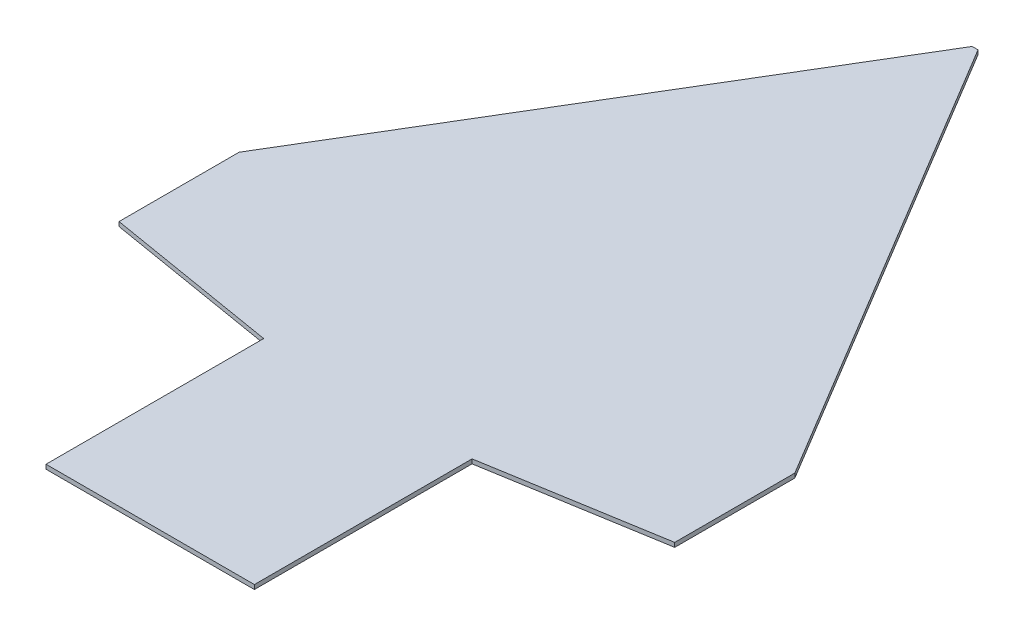
ISO-10303-21;
HEADER;
FILE_DESCRIPTION(('STEP AP214'),'2;1');
FILE_NAME('part.step','',(''),(''),'','','');
FILE_SCHEMA(('AUTOMOTIVE_DESIGN { 1 0 10303 214 1 1 1 1 }'));
ENDSEC;
DATA;
#1=APPLICATION_CONTEXT('core data for automotive mechanical design processes');
#2=APPLICATION_PROTOCOL_DEFINITION('international standard','automotive_design',2000,#1);
#3=PRODUCT_CONTEXT('',#1,'mechanical');
#4=PRODUCT('Part','Part','',(#3));
#5=PRODUCT_RELATED_PRODUCT_CATEGORY('part','',(#4));
#6=PRODUCT_DEFINITION_FORMATION('','',#4);
#7=PRODUCT_DEFINITION_CONTEXT('part definition',#1,'design');
#8=PRODUCT_DEFINITION('design','',#6,#7);
#9=PRODUCT_DEFINITION_SHAPE('','',#8);
#10=(LENGTH_UNIT() NAMED_UNIT(*) SI_UNIT(.MILLI.,.METRE.));
#11=(NAMED_UNIT(*) PLANE_ANGLE_UNIT() SI_UNIT($,.RADIAN.));
#12=(NAMED_UNIT(*) SI_UNIT($,.STERADIAN.) SOLID_ANGLE_UNIT());
#13=UNCERTAINTY_MEASURE_WITH_UNIT(LENGTH_MEASURE(1.E-05),#10,'distance_accuracy_value','');
#14=(GEOMETRIC_REPRESENTATION_CONTEXT(3) GLOBAL_UNCERTAINTY_ASSIGNED_CONTEXT((#13)) GLOBAL_UNIT_ASSIGNED_CONTEXT((#10,
#11,#12)) REPRESENTATION_CONTEXT('',''));
#15=CARTESIAN_POINT('',(0.,0.,0.));
#16=DIRECTION('',(0.,0.,1.));
#17=DIRECTION('',(1.,0.,0.));
#18=AXIS2_PLACEMENT_3D('',#15,#16,#17);
#19=CARTESIAN_POINT('',(-139.143029512937,2.54,0.));
#20=DIRECTION('',(1.,0.,0.));
#21=DIRECTION('',(0.,0.,-1.));
#22=AXIS2_PLACEMENT_3D('',#19,#20,#21);
#23=PLANE('',#22);
#24=DIRECTION('',(0.,0.,1.));
#25=VECTOR('',#24,1.);
#26=CARTESIAN_POINT('',(-139.143029512937,0.,0.));
#27=LINE('',#26,#25);
#28=CARTESIAN_POINT('',(-139.143029512937,0.,185.803434051227));
#29=VERTEX_POINT('',#28);
#30=CARTESIAN_POINT('',(-139.143029512937,0.,256.063525810857));
#31=VERTEX_POINT('',#30);
#32=EDGE_CURVE('E145',#29,#31,#27,.T.);
#33=ORIENTED_EDGE('',*,*,#32,.T.);
#34=DIRECTION('',(0.,-1.,0.));
#35=VECTOR('',#34,1.);
#36=CARTESIAN_POINT('',(-139.143029512937,2.54,256.063525810857));
#37=LINE('',#36,#35);
#38=CARTESIAN_POINT('',(-139.143029512937,2.54,256.063525810857));
#39=VERTEX_POINT('',#38);
#40=EDGE_CURVE('E11',#39,#31,#37,.T.);
#41=ORIENTED_EDGE('',*,*,#40,.F.);
#42=DIRECTION('',(0.,0.,1.));
#43=VECTOR('',#42,1.);
#44=CARTESIAN_POINT('',(-139.143029512937,2.54,0.));
#45=LINE('',#44,#43);
#46=CARTESIAN_POINT('',(-139.143029512937,2.54,185.803434051227));
#47=VERTEX_POINT('',#46);
#48=EDGE_CURVE('E166',#47,#39,#45,.T.);
#49=ORIENTED_EDGE('',*,*,#48,.F.);
#50=DIRECTION('',(0.,-1.,0.));
#51=VECTOR('',#50,1.);
#52=CARTESIAN_POINT('',(-139.143029512937,2.54,185.803434051227));
#53=LINE('',#52,#51);
#54=EDGE_CURVE('E144',#47,#29,#53,.T.);
#55=ORIENTED_EDGE('',*,*,#54,.T.);
#56=EDGE_LOOP('',(#33,#41,#49,#55));
#57=FACE_BOUND('',#56,.T.);
#58=ADVANCED_FACE('F35',(#57),#23,.F.);
#59=CARTESIAN_POINT('',(-45.3878948757249,2.54,271.72407483493));
#60=DIRECTION('',(0.164754096556376,0.,-0.986334673256442));
#61=DIRECTION('',(-0.986334673256442,0.,-0.164754096556376));
#62=AXIS2_PLACEMENT_3D('',#59,#60,#61);
#63=PLANE('',#62);
#64=DIRECTION('',(0.986334673256442,0.,0.164754096556376));
#65=VECTOR('',#64,1.);
#66=CARTESIAN_POINT('',(-45.3878948757249,0.,271.72407483493));
#67=LINE('',#66,#65);
#68=CARTESIAN_POINT('',(-37.5430295129392,0.,273.034455317839));
#69=VERTEX_POINT('',#68);
#70=EDGE_CURVE('E148',#31,#69,#67,.T.);
#71=ORIENTED_EDGE('',*,*,#70,.T.);
#72=DIRECTION('',(0.,-1.,0.));
#73=VECTOR('',#72,1.);
#74=CARTESIAN_POINT('',(-37.5430295129392,2.54,273.034455317839));
#75=LINE('',#74,#73);
#76=CARTESIAN_POINT('',(-37.5430295129392,2.54,273.034455317839));
#77=VERTEX_POINT('',#76);
#78=EDGE_CURVE('E43',#77,#69,#75,.T.);
#79=ORIENTED_EDGE('',*,*,#78,.F.);
#80=DIRECTION('',(0.986334673256442,0.,0.164754096556376));
#81=VECTOR('',#80,1.);
#82=CARTESIAN_POINT('',(-45.3878948757249,2.54,271.72407483493));
#83=LINE('',#82,#81);
#84=EDGE_CURVE('E99',#39,#77,#83,.T.);
#85=ORIENTED_EDGE('',*,*,#84,.F.);
#86=ORIENTED_EDGE('',*,*,#40,.T.);
#87=EDGE_LOOP('',(#71,#79,#85,#86));
#88=FACE_BOUND('',#87,.T.);
#89=ADVANCED_FACE('F210',(#88),#63,.F.);
#90=CARTESIAN_POINT('',(-37.5430295129392,2.54,0.));
#91=DIRECTION('',(1.,0.,0.));
#92=DIRECTION('',(0.,0.,-1.));
#93=AXIS2_PLACEMENT_3D('',#90,#91,#92);
#94=PLANE('',#93);
#95=DIRECTION('',(0.,0.,1.));
#96=VECTOR('',#95,1.);
#97=CARTESIAN_POINT('',(-37.5430295129392,0.,0.));
#98=LINE('',#97,#96);
#99=CARTESIAN_POINT('',(-37.5430295129392,0.,400.386363558214));
#100=VERTEX_POINT('',#99);
#101=EDGE_CURVE('E150',#69,#100,#98,.T.);
#102=ORIENTED_EDGE('',*,*,#101,.T.);
#103=DIRECTION('',(0.,-1.,0.));
#104=VECTOR('',#103,1.);
#105=CARTESIAN_POINT('',(-37.5430295129392,2.54,400.386363558214));
#106=LINE('',#105,#104);
#107=CARTESIAN_POINT('',(-37.5430295129392,2.54,400.386363558214));
#108=VERTEX_POINT('',#107);
#109=EDGE_CURVE('E177',#108,#100,#106,.T.);
#110=ORIENTED_EDGE('',*,*,#109,.F.);
#111=DIRECTION('',(0.,0.,1.));
#112=VECTOR('',#111,1.);
#113=CARTESIAN_POINT('',(-37.5430295129392,2.54,0.));
#114=LINE('',#113,#112);
#115=EDGE_CURVE('E185',#77,#108,#114,.T.);
#116=ORIENTED_EDGE('',*,*,#115,.F.);
#117=ORIENTED_EDGE('',*,*,#78,.T.);
#118=EDGE_LOOP('',(#102,#110,#116,#117));
#119=FACE_BOUND('',#118,.T.);
#120=ADVANCED_FACE('F183',(#119),#94,.F.);
#121=CARTESIAN_POINT('',(0.,2.54,400.386363558214));
#122=DIRECTION('',(0.,0.,-1.));
#123=DIRECTION('',(-1.,0.,0.));
#124=AXIS2_PLACEMENT_3D('',#121,#122,#123);
#125=PLANE('',#124);
#126=DIRECTION('',(1.,0.,0.));
#127=VECTOR('',#126,1.);
#128=CARTESIAN_POINT('',(0.,0.,400.386363558214));
#129=LINE('',#128,#127);
#130=CARTESIAN_POINT('',(84.3769704870607,0.,400.386363558214));
#131=VERTEX_POINT('',#130);
#132=EDGE_CURVE('E152',#100,#131,#129,.T.);
#133=ORIENTED_EDGE('',*,*,#132,.T.);
#134=DIRECTION('',(0.,-1.,0.));
#135=VECTOR('',#134,1.);
#136=CARTESIAN_POINT('',(84.3769704870607,2.54,400.386363558214));
#137=LINE('',#136,#135);
#138=CARTESIAN_POINT('',(84.3769704870607,2.54,400.386363558214));
#139=VERTEX_POINT('',#138);
#140=EDGE_CURVE('E174',#139,#131,#137,.T.);
#141=ORIENTED_EDGE('',*,*,#140,.F.);
#142=DIRECTION('',(1.,0.,0.));
#143=VECTOR('',#142,1.);
#144=CARTESIAN_POINT('',(0.,2.54,400.386363558214));
#145=LINE('',#144,#143);
#146=EDGE_CURVE('E201',#108,#139,#145,.T.);
#147=ORIENTED_EDGE('',*,*,#146,.F.);
#148=ORIENTED_EDGE('',*,*,#109,.T.);
#149=EDGE_LOOP('',(#133,#141,#147,#148));
#150=FACE_BOUND('',#149,.T.);
#151=ADVANCED_FACE('F193',(#150),#125,.F.);
#152=CARTESIAN_POINT('',(84.3769704870607,2.54,0.));
#153=DIRECTION('',(-1.,0.,0.));
#154=DIRECTION('',(0.,0.,1.));
#155=AXIS2_PLACEMENT_3D('',#152,#153,#154);
#156=PLANE('',#155);
#157=DIRECTION('',(0.,0.,-1.));
#158=VECTOR('',#157,1.);
#159=CARTESIAN_POINT('',(84.3769704870607,0.,0.));
#160=LINE('',#159,#158);
#161=CARTESIAN_POINT('',(84.3769704870607,0.,273.03445531784));
#162=VERTEX_POINT('',#161);
#163=EDGE_CURVE('E154',#131,#162,#160,.T.);
#164=ORIENTED_EDGE('',*,*,#163,.T.);
#165=DIRECTION('',(0.,-1.,0.));
#166=VECTOR('',#165,1.);
#167=CARTESIAN_POINT('',(84.3769704870607,2.54,273.03445531784));
#168=LINE('',#167,#166);
#169=CARTESIAN_POINT('',(84.3769704870607,2.54,273.03445531784));
#170=VERTEX_POINT('',#169);
#171=EDGE_CURVE('E172',#170,#162,#168,.T.);
#172=ORIENTED_EDGE('',*,*,#171,.F.);
#173=DIRECTION('',(0.,0.,-1.));
#174=VECTOR('',#173,1.);
#175=CARTESIAN_POINT('',(84.3769704870607,2.54,0.));
#176=LINE('',#175,#174);
#177=EDGE_CURVE('E199',#139,#170,#176,.T.);
#178=ORIENTED_EDGE('',*,*,#177,.F.);
#179=ORIENTED_EDGE('',*,*,#140,.T.);
#180=EDGE_LOOP('',(#164,#172,#178,#179));
#181=FACE_BOUND('',#180,.T.);
#182=ADVANCED_FACE('F197',(#181),#156,.F.);
#183=CARTESIAN_POINT('',(46.6591512636648,2.54,279.334715664266));
#184=DIRECTION('',(0.164754096556276,0.,0.986334673256459));
#185=DIRECTION('',(0.986334673256459,0.,-0.164754096556276));
#186=AXIS2_PLACEMENT_3D('',#183,#184,#185);
#187=PLANE('',#186);
#188=DIRECTION('',(-0.986334673256459,0.,0.164754096556276));
#189=VECTOR('',#188,1.);
#190=CARTESIAN_POINT('',(46.6591512636648,0.,279.334715664266));
#191=LINE('',#190,#189);
#192=CARTESIAN_POINT('',(185.976970487061,0.,256.063525810868));
#193=VERTEX_POINT('',#192);
#194=EDGE_CURVE('E157',#193,#162,#191,.T.);
#195=ORIENTED_EDGE('',*,*,#194,.F.);
#196=DIRECTION('',(0.,-1.,0.));
#197=VECTOR('',#196,1.);
#198=CARTESIAN_POINT('',(185.976970487061,2.54,256.063525810868));
#199=LINE('',#198,#197);
#200=CARTESIAN_POINT('',(185.976970487061,2.54,256.063525810868));
#201=VERTEX_POINT('',#200);
#202=EDGE_CURVE('E170',#201,#193,#199,.T.);
#203=ORIENTED_EDGE('',*,*,#202,.F.);
#204=DIRECTION('',(-0.986334673256459,0.,0.164754096556276));
#205=VECTOR('',#204,1.);
#206=CARTESIAN_POINT('',(46.6591512636648,2.54,279.334715664266));
#207=LINE('',#206,#205);
#208=EDGE_CURVE('E139',#201,#170,#207,.T.);
#209=ORIENTED_EDGE('',*,*,#208,.T.);
#210=ORIENTED_EDGE('',*,*,#171,.T.);
#211=EDGE_LOOP('',(#195,#203,#209,#210));
#212=FACE_BOUND('',#211,.T.);
#213=ADVANCED_FACE('F222',(#212),#187,.T.);
#214=CARTESIAN_POINT('',(185.976970487061,2.54,0.));
#215=DIRECTION('',(1.,0.,0.));
#216=DIRECTION('',(0.,0.,-1.));
#217=AXIS2_PLACEMENT_3D('',#214,#215,#216);
#218=PLANE('',#217);
#219=DIRECTION('',(0.,0.,1.));
#220=VECTOR('',#219,1.);
#221=CARTESIAN_POINT('',(185.976970487061,0.,0.));
#222=LINE('',#221,#220);
#223=CARTESIAN_POINT('',(185.976970487061,0.,185.803434051242));
#224=VERTEX_POINT('',#223);
#225=EDGE_CURVE('E160',#224,#193,#222,.T.);
#226=ORIENTED_EDGE('',*,*,#225,.F.);
#227=DIRECTION('',(0.,-1.,0.));
#228=VECTOR('',#227,1.);
#229=CARTESIAN_POINT('',(185.976970487061,2.54,185.803434051242));
#230=LINE('',#229,#228);
#231=CARTESIAN_POINT('',(185.976970487061,2.54,185.803434051242));
#232=VERTEX_POINT('',#231);
#233=EDGE_CURVE('E127',#232,#224,#230,.T.);
#234=ORIENTED_EDGE('',*,*,#233,.F.);
#235=DIRECTION('',(0.,0.,1.));
#236=VECTOR('',#235,1.);
#237=CARTESIAN_POINT('',(185.976970487061,2.54,0.));
#238=LINE('',#237,#236);
#239=EDGE_CURVE('E137',#232,#201,#238,.T.);
#240=ORIENTED_EDGE('',*,*,#239,.T.);
#241=ORIENTED_EDGE('',*,*,#202,.T.);
#242=EDGE_LOOP('',(#226,#234,#240,#241));
#243=FACE_BOUND('',#242,.T.);
#244=ADVANCED_FACE('F225',(#243),#218,.T.);
#245=CARTESIAN_POINT('',(54.7510275756096,2.54,-32.8579118116525));
#246=DIRECTION('',(0.857442517454998,0.,-0.514579759862779));
#247=DIRECTION('',(-0.514579759862779,0.,-0.857442517454998));
#248=AXIS2_PLACEMENT_3D('',#245,#246,#247);
#249=PLANE('',#248);
#250=DIRECTION('',(0.514579759862779,0.,0.857442517454998));
#251=VECTOR('',#250,1.);
#252=CARTESIAN_POINT('',(54.7510275756096,0.,-32.8579118116525));
#253=LINE('',#252,#251);
#254=CARTESIAN_POINT('',(25.1310164249957,0.,-82.213636441786));
#255=VERTEX_POINT('',#254);
#256=EDGE_CURVE('E126',#255,#224,#253,.T.);
#257=ORIENTED_EDGE('',*,*,#256,.F.);
#258=DIRECTION('',(0.,-1.,0.));
#259=VECTOR('',#258,1.);
#260=CARTESIAN_POINT('',(25.1310164249957,2.54,-82.213636441786));
#261=LINE('',#260,#259);
#262=CARTESIAN_POINT('',(25.1310164249957,2.54,-82.213636441786));
#263=VERTEX_POINT('',#262);
#264=EDGE_CURVE('E120',#263,#255,#261,.T.);
#265=ORIENTED_EDGE('',*,*,#264,.F.);
#266=DIRECTION('',(0.514579759862779,0.,0.857442517454998));
#267=VECTOR('',#266,1.);
#268=CARTESIAN_POINT('',(54.7510275756096,2.54,-32.8579118116525));
#269=LINE('',#268,#267);
#270=EDGE_CURVE('E124',#263,#232,#269,.T.);
#271=ORIENTED_EDGE('',*,*,#270,.T.);
#272=ORIENTED_EDGE('',*,*,#233,.T.);
#273=EDGE_LOOP('',(#257,#265,#271,#272));
#274=FACE_BOUND('',#273,.T.);
#275=ADVANCED_FACE('F122',(#274),#249,.T.);
#276=CARTESIAN_POINT('',(0.,2.54,-82.213636441786));
#277=DIRECTION('',(0.,0.,1.));
#278=DIRECTION('',(1.,0.,0.));
#279=AXIS2_PLACEMENT_3D('',#276,#277,#278);
#280=PLANE('',#279);
#281=DIRECTION('',(-1.,0.,0.));
#282=VECTOR('',#281,1.);
#283=CARTESIAN_POINT('',(0.,0.,-82.213636441786));
#284=LINE('',#283,#282);
#285=CARTESIAN_POINT('',(21.7029245491262,0.,-82.213636441786));
#286=VERTEX_POINT('',#285);
#287=EDGE_CURVE('E85',#255,#286,#284,.T.);
#288=ORIENTED_EDGE('',*,*,#287,.T.);
#289=DIRECTION('',(0.,-1.,0.));
#290=VECTOR('',#289,1.);
#291=CARTESIAN_POINT('',(21.7029245491262,2.54,-82.213636441786));
#292=LINE('',#291,#290);
#293=CARTESIAN_POINT('',(21.7029245491262,2.54,-82.213636441786));
#294=VERTEX_POINT('',#293);
#295=EDGE_CURVE('E128',#294,#286,#292,.T.);
#296=ORIENTED_EDGE('',*,*,#295,.F.);
#297=DIRECTION('',(-1.,0.,0.));
#298=VECTOR('',#297,1.);
#299=CARTESIAN_POINT('',(0.,2.54,-82.213636441786));
#300=LINE('',#299,#298);
#301=EDGE_CURVE('E130',#263,#294,#300,.T.);
#302=ORIENTED_EDGE('',*,*,#301,.F.);
#303=ORIENTED_EDGE('',*,*,#264,.T.);
#304=EDGE_LOOP('',(#288,#296,#302,#303));
#305=FACE_BOUND('',#304,.T.);
#306=ADVANCED_FACE('F131',(#305),#280,.F.);
#307=CARTESIAN_POINT('',(-20.3183549204723,2.54,-12.1937202587257));
#308=DIRECTION('',(0.857442517454988,0.,0.514579759862795));
#309=DIRECTION('',(0.514579759862795,0.,-0.857442517454988));
#310=AXIS2_PLACEMENT_3D('',#307,#308,#309);
#311=PLANE('',#310);
#312=DIRECTION('',(-0.514579759862795,0.,0.857442517454988));
#313=VECTOR('',#312,1.);
#314=CARTESIAN_POINT('',(-20.3183549204723,0.,-12.1937202587257));
#315=LINE('',#314,#313);
#316=EDGE_CURVE('E91',#286,#29,#315,.T.);
#317=ORIENTED_EDGE('',*,*,#316,.T.);
#318=ORIENTED_EDGE('',*,*,#54,.F.);
#319=DIRECTION('',(-0.514579759862795,0.,0.857442517454988));
#320=VECTOR('',#319,1.);
#321=CARTESIAN_POINT('',(-20.3183549204723,2.54,-12.1937202587257));
#322=LINE('',#321,#320);
#323=EDGE_CURVE('E51',#294,#47,#322,.T.);
#324=ORIENTED_EDGE('',*,*,#323,.F.);
#325=ORIENTED_EDGE('',*,*,#295,.T.);
#326=EDGE_LOOP('',(#317,#318,#324,#325));
#327=FACE_BOUND('',#326,.T.);
#328=ADVANCED_FACE('F234',(#327),#311,.F.);
#329=CARTESIAN_POINT('',(0.,2.54,0.));
#330=DIRECTION('',(0.,1.,0.));
#331=DIRECTION('',(0.,0.,1.));
#332=AXIS2_PLACEMENT_3D('',#329,#330,#331);
#333=PLANE('',#332);
#334=ORIENTED_EDGE('',*,*,#48,.T.);
#335=ORIENTED_EDGE('',*,*,#84,.T.);
#336=ORIENTED_EDGE('',*,*,#115,.T.);
#337=ORIENTED_EDGE('',*,*,#146,.T.);
#338=ORIENTED_EDGE('',*,*,#177,.T.);
#339=ORIENTED_EDGE('',*,*,#208,.F.);
#340=ORIENTED_EDGE('',*,*,#239,.F.);
#341=ORIENTED_EDGE('',*,*,#270,.F.);
#342=ORIENTED_EDGE('',*,*,#301,.T.);
#343=ORIENTED_EDGE('',*,*,#323,.T.);
#344=EDGE_LOOP('',(#334,#335,#336,#337,#338,#339,#340,#341,#342,#343));
#345=FACE_BOUND('',#344,.T.);
#346=ADVANCED_FACE('F134',(#345),#333,.T.);
#347=CARTESIAN_POINT('',(0.,0.,0.));
#348=DIRECTION('',(0.,1.,0.));
#349=DIRECTION('',(0.,0.,1.));
#350=AXIS2_PLACEMENT_3D('',#347,#348,#349);
#351=PLANE('',#350);
#352=ORIENTED_EDGE('',*,*,#32,.F.);
#353=ORIENTED_EDGE('',*,*,#316,.F.);
#354=ORIENTED_EDGE('',*,*,#287,.F.);
#355=ORIENTED_EDGE('',*,*,#256,.T.);
#356=ORIENTED_EDGE('',*,*,#225,.T.);
#357=ORIENTED_EDGE('',*,*,#194,.T.);
#358=ORIENTED_EDGE('',*,*,#163,.F.);
#359=ORIENTED_EDGE('',*,*,#132,.F.);
#360=ORIENTED_EDGE('',*,*,#101,.F.);
#361=ORIENTED_EDGE('',*,*,#70,.F.);
#362=EDGE_LOOP('',(#352,#353,#354,#355,#356,#357,#358,#359,#360,#361));
#363=FACE_BOUND('',#362,.T.);
#364=ADVANCED_FACE('F189',(#363),#351,.F.);
#365=CLOSED_SHELL('',(#58,#89,#120,#151,#182,#213,#244,#275,#306,#328,#346,#364));
#366=MANIFOLD_SOLID_BREP('B2',#365);
#367=ADVANCED_BREP_SHAPE_REPRESENTATION('',(#18,#366),#14);
#368=SHAPE_DEFINITION_REPRESENTATION(#9,#367);
ENDSEC;
END-ISO-10303-21;
